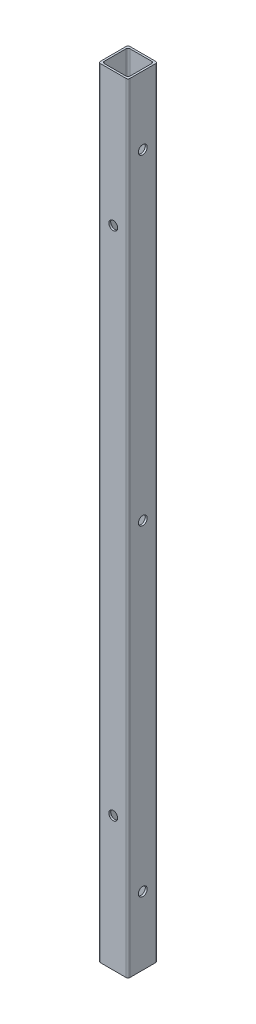
ISO-10303-21;
HEADER;
FILE_DESCRIPTION(('STEP AP214'),'2;1');
FILE_NAME('part.step','',(''),(''),'','','');
FILE_SCHEMA(('AUTOMOTIVE_DESIGN { 1 0 10303 214 1 1 1 1 }'));
ENDSEC;
DATA;
#1=APPLICATION_CONTEXT('core data for automotive mechanical design processes');
#2=APPLICATION_PROTOCOL_DEFINITION('international standard','automotive_design',2000,#1);
#3=PRODUCT_CONTEXT('',#1,'mechanical');
#4=PRODUCT('Part','Part','',(#3));
#5=PRODUCT_RELATED_PRODUCT_CATEGORY('part','',(#4));
#6=PRODUCT_DEFINITION_FORMATION('','',#4);
#7=PRODUCT_DEFINITION_CONTEXT('part definition',#1,'design');
#8=PRODUCT_DEFINITION('design','',#6,#7);
#9=PRODUCT_DEFINITION_SHAPE('','',#8);
#10=(LENGTH_UNIT() NAMED_UNIT(*) SI_UNIT(.MILLI.,.METRE.));
#11=(NAMED_UNIT(*) PLANE_ANGLE_UNIT() SI_UNIT($,.RADIAN.));
#12=(NAMED_UNIT(*) SI_UNIT($,.STERADIAN.) SOLID_ANGLE_UNIT());
#13=UNCERTAINTY_MEASURE_WITH_UNIT(LENGTH_MEASURE(1.E-05),#10,'distance_accuracy_value','');
#14=(GEOMETRIC_REPRESENTATION_CONTEXT(3) GLOBAL_UNCERTAINTY_ASSIGNED_CONTEXT((#13)) GLOBAL_UNIT_ASSIGNED_CONTEXT((#10,
#11,#12)) REPRESENTATION_CONTEXT('',''));
#15=CARTESIAN_POINT('',(0.,0.,0.));
#16=DIRECTION('',(0.,0.,1.));
#17=DIRECTION('',(1.,0.,0.));
#18=AXIS2_PLACEMENT_3D('',#15,#16,#17);
#19=CARTESIAN_POINT('',(0.,508.,0.));
#20=DIRECTION('',(0.,-1.,0.));
#21=DIRECTION('',(0.,0.,-1.));
#22=AXIS2_PLACEMENT_3D('',#19,#20,#21);
#23=PLANE('',#22);
#24=DIRECTION('',(0.,0.,1.));
#25=VECTOR('',#24,1.);
#26=CARTESIAN_POINT('',(-9.652,508.,9.652));
#27=LINE('',#26,#25);
#28=CARTESIAN_POINT('',(-9.652,508.,-8.382));
#29=VERTEX_POINT('',#28);
#30=CARTESIAN_POINT('',(-9.652,508.,8.382));
#31=VERTEX_POINT('',#30);
#32=EDGE_CURVE('E180',#29,#31,#27,.T.);
#33=ORIENTED_EDGE('',*,*,#32,.T.);
#34=CARTESIAN_POINT('',(-8.382,508.,8.382));
#35=DIRECTION('',(0.,-1.,0.));
#36=DIRECTION('',(0.,0.,-1.));
#37=AXIS2_PLACEMENT_3D('',#34,#35,#36);
#38=CIRCLE('',#37,1.27);
#39=CARTESIAN_POINT('',(-8.382,508.,9.652));
#40=VERTEX_POINT('',#39);
#41=EDGE_CURVE('E222',#31,#40,#38,.F.);
#42=ORIENTED_EDGE('',*,*,#41,.T.);
#43=DIRECTION('',(1.,0.,0.));
#44=VECTOR('',#43,1.);
#45=CARTESIAN_POINT('',(-9.652,508.,9.652));
#46=LINE('',#45,#44);
#47=CARTESIAN_POINT('',(8.382,508.,9.652));
#48=VERTEX_POINT('',#47);
#49=EDGE_CURVE('E175',#40,#48,#46,.T.);
#50=ORIENTED_EDGE('',*,*,#49,.T.);
#51=CARTESIAN_POINT('',(8.382,508.,8.382));
#52=DIRECTION('',(0.,-1.,0.));
#53=DIRECTION('',(0.,0.,-1.));
#54=AXIS2_PLACEMENT_3D('',#51,#52,#53);
#55=CIRCLE('',#54,1.27);
#56=CARTESIAN_POINT('',(9.652,508.,8.382));
#57=VERTEX_POINT('',#56);
#58=EDGE_CURVE('E217',#48,#57,#55,.F.);
#59=ORIENTED_EDGE('',*,*,#58,.T.);
#60=DIRECTION('',(0.,0.,-1.));
#61=VECTOR('',#60,1.);
#62=CARTESIAN_POINT('',(9.652,508.,9.652));
#63=LINE('',#62,#61);
#64=CARTESIAN_POINT('',(9.652,508.,-8.382));
#65=VERTEX_POINT('',#64);
#66=EDGE_CURVE('E301',#57,#65,#63,.T.);
#67=ORIENTED_EDGE('',*,*,#66,.T.);
#68=CARTESIAN_POINT('',(8.382,508.,-8.382));
#69=DIRECTION('',(0.,-1.,0.));
#70=DIRECTION('',(0.,0.,-1.));
#71=AXIS2_PLACEMENT_3D('',#68,#69,#70);
#72=CIRCLE('',#71,1.27);
#73=CARTESIAN_POINT('',(8.382,508.,-9.652));
#74=VERTEX_POINT('',#73);
#75=EDGE_CURVE('E58',#65,#74,#72,.F.);
#76=ORIENTED_EDGE('',*,*,#75,.T.);
#77=DIRECTION('',(-1.,0.,0.));
#78=VECTOR('',#77,1.);
#79=CARTESIAN_POINT('',(-9.652,508.,-9.652));
#80=LINE('',#79,#78);
#81=CARTESIAN_POINT('',(-8.382,508.,-9.652));
#82=VERTEX_POINT('',#81);
#83=EDGE_CURVE('E303',#74,#82,#80,.T.);
#84=ORIENTED_EDGE('',*,*,#83,.T.);
#85=CARTESIAN_POINT('',(-8.382,508.,-8.382));
#86=DIRECTION('',(0.,-1.,0.));
#87=DIRECTION('',(0.,0.,-1.));
#88=AXIS2_PLACEMENT_3D('',#85,#86,#87);
#89=CIRCLE('',#88,1.27);
#90=EDGE_CURVE('E220',#82,#29,#89,.F.);
#91=ORIENTED_EDGE('',*,*,#90,.T.);
#92=EDGE_LOOP('',(#33,#42,#50,#59,#67,#76,#84,#91));
#93=FACE_BOUND('',#92,.T.);
#94=DIRECTION('',(1.,0.,0.));
#95=VECTOR('',#94,1.);
#96=CARTESIAN_POINT('',(-8.382,508.,8.382));
#97=LINE('',#96,#95);
#98=CARTESIAN_POINT('',(-7.112,508.,8.382));
#99=VERTEX_POINT('',#98);
#100=CARTESIAN_POINT('',(7.112,508.,8.382));
#101=VERTEX_POINT('',#100);
#102=EDGE_CURVE('E284',#99,#101,#97,.T.);
#103=ORIENTED_EDGE('',*,*,#102,.F.);
#104=CARTESIAN_POINT('',(-7.112,508.,7.112));
#105=DIRECTION('',(0.,-1.,0.));
#106=DIRECTION('',(0.,0.,-1.));
#107=AXIS2_PLACEMENT_3D('',#104,#105,#106);
#108=CIRCLE('',#107,1.27);
#109=CARTESIAN_POINT('',(-8.382,508.,7.112));
#110=VERTEX_POINT('',#109);
#111=EDGE_CURVE('E11',#99,#110,#108,.T.);
#112=ORIENTED_EDGE('',*,*,#111,.T.);
#113=DIRECTION('',(0.,0.,1.));
#114=VECTOR('',#113,1.);
#115=CARTESIAN_POINT('',(-8.382,508.,8.382));
#116=LINE('',#115,#114);
#117=CARTESIAN_POINT('',(-8.382,508.,-7.11199999999999));
#118=VERTEX_POINT('',#117);
#119=EDGE_CURVE('E292',#118,#110,#116,.T.);
#120=ORIENTED_EDGE('',*,*,#119,.F.);
#121=CARTESIAN_POINT('',(-7.112,508.,-7.112));
#122=DIRECTION('',(0.,-1.,0.));
#123=DIRECTION('',(0.,0.,-1.));
#124=AXIS2_PLACEMENT_3D('',#121,#122,#123);
#125=CIRCLE('',#124,1.27);
#126=CARTESIAN_POINT('',(-7.112,508.,-8.382));
#127=VERTEX_POINT('',#126);
#128=EDGE_CURVE('E235',#118,#127,#125,.T.);
#129=ORIENTED_EDGE('',*,*,#128,.T.);
#130=DIRECTION('',(-1.,0.,0.));
#131=VECTOR('',#130,1.);
#132=CARTESIAN_POINT('',(-8.382,508.,-8.382));
#133=LINE('',#132,#131);
#134=CARTESIAN_POINT('',(7.112,508.,-8.382));
#135=VERTEX_POINT('',#134);
#136=EDGE_CURVE('E290',#135,#127,#133,.T.);
#137=ORIENTED_EDGE('',*,*,#136,.F.);
#138=CARTESIAN_POINT('',(7.112,508.,-7.112));
#139=DIRECTION('',(0.,-1.,0.));
#140=DIRECTION('',(0.,0.,-1.));
#141=AXIS2_PLACEMENT_3D('',#138,#139,#140);
#142=CIRCLE('',#141,1.27);
#143=CARTESIAN_POINT('',(8.382,508.,-7.11199999999999));
#144=VERTEX_POINT('',#143);
#145=EDGE_CURVE('E160',#135,#144,#142,.T.);
#146=ORIENTED_EDGE('',*,*,#145,.T.);
#147=DIRECTION('',(0.,0.,-1.));
#148=VECTOR('',#147,1.);
#149=CARTESIAN_POINT('',(8.382,508.,8.382));
#150=LINE('',#149,#148);
#151=CARTESIAN_POINT('',(8.382,508.,7.112));
#152=VERTEX_POINT('',#151);
#153=EDGE_CURVE('E287',#152,#144,#150,.T.);
#154=ORIENTED_EDGE('',*,*,#153,.F.);
#155=CARTESIAN_POINT('',(7.112,508.,7.112));
#156=DIRECTION('',(0.,-1.,0.));
#157=DIRECTION('',(0.,0.,-1.));
#158=AXIS2_PLACEMENT_3D('',#155,#156,#157);
#159=CIRCLE('',#158,1.27);
#160=EDGE_CURVE('E161',#152,#101,#159,.T.);
#161=ORIENTED_EDGE('',*,*,#160,.T.);
#162=EDGE_LOOP('',(#103,#112,#120,#129,#137,#146,#154,#161));
#163=FACE_BOUND('',#162,.T.);
#164=ADVANCED_FACE('F34',(#93,#163),#23,.F.);
#165=CARTESIAN_POINT('',(0.,0.,0.));
#166=DIRECTION('',(0.,-1.,0.));
#167=DIRECTION('',(0.,0.,-1.));
#168=AXIS2_PLACEMENT_3D('',#165,#166,#167);
#169=PLANE('',#168);
#170=DIRECTION('',(1.,0.,0.));
#171=VECTOR('',#170,1.);
#172=CARTESIAN_POINT('',(-9.652,0.,9.652));
#173=LINE('',#172,#171);
#174=CARTESIAN_POINT('',(-8.382,0.,9.652));
#175=VERTEX_POINT('',#174);
#176=CARTESIAN_POINT('',(8.382,0.,9.652));
#177=VERTEX_POINT('',#176);
#178=EDGE_CURVE('E183',#175,#177,#173,.T.);
#179=ORIENTED_EDGE('',*,*,#178,.F.);
#180=CARTESIAN_POINT('',(-8.382,0.,8.382));
#181=DIRECTION('',(0.,-1.,0.));
#182=DIRECTION('',(0.,0.,-1.));
#183=AXIS2_PLACEMENT_3D('',#180,#181,#182);
#184=CIRCLE('',#183,1.27);
#185=CARTESIAN_POINT('',(-9.652,0.,8.382));
#186=VERTEX_POINT('',#185);
#187=EDGE_CURVE('E210',#175,#186,#184,.T.);
#188=ORIENTED_EDGE('',*,*,#187,.T.);
#189=DIRECTION('',(0.,0.,1.));
#190=VECTOR('',#189,1.);
#191=CARTESIAN_POINT('',(-9.652,0.,9.652));
#192=LINE('',#191,#190);
#193=CARTESIAN_POINT('',(-9.652,0.,-8.382));
#194=VERTEX_POINT('',#193);
#195=EDGE_CURVE('E310',#194,#186,#192,.T.);
#196=ORIENTED_EDGE('',*,*,#195,.F.);
#197=CARTESIAN_POINT('',(-8.382,0.,-8.382));
#198=DIRECTION('',(0.,-1.,0.));
#199=DIRECTION('',(0.,0.,-1.));
#200=AXIS2_PLACEMENT_3D('',#197,#198,#199);
#201=CIRCLE('',#200,1.27);
#202=CARTESIAN_POINT('',(-8.382,0.,-9.652));
#203=VERTEX_POINT('',#202);
#204=EDGE_CURVE('E208',#194,#203,#201,.T.);
#205=ORIENTED_EDGE('',*,*,#204,.T.);
#206=DIRECTION('',(-1.,0.,0.));
#207=VECTOR('',#206,1.);
#208=CARTESIAN_POINT('',(-9.652,0.,-9.652));
#209=LINE('',#208,#207);
#210=CARTESIAN_POINT('',(8.382,0.,-9.652));
#211=VERTEX_POINT('',#210);
#212=EDGE_CURVE('E309',#211,#203,#209,.T.);
#213=ORIENTED_EDGE('',*,*,#212,.F.);
#214=CARTESIAN_POINT('',(8.382,0.,-8.382));
#215=DIRECTION('',(0.,-1.,0.));
#216=DIRECTION('',(0.,0.,-1.));
#217=AXIS2_PLACEMENT_3D('',#214,#215,#216);
#218=CIRCLE('',#217,1.27);
#219=CARTESIAN_POINT('',(9.652,0.,-8.382));
#220=VERTEX_POINT('',#219);
#221=EDGE_CURVE('E206',#211,#220,#218,.T.);
#222=ORIENTED_EDGE('',*,*,#221,.T.);
#223=DIRECTION('',(0.,0.,-1.));
#224=VECTOR('',#223,1.);
#225=CARTESIAN_POINT('',(9.652,0.,9.652));
#226=LINE('',#225,#224);
#227=CARTESIAN_POINT('',(9.652,0.,8.382));
#228=VERTEX_POINT('',#227);
#229=EDGE_CURVE('E295',#228,#220,#226,.T.);
#230=ORIENTED_EDGE('',*,*,#229,.F.);
#231=CARTESIAN_POINT('',(8.382,0.,8.382));
#232=DIRECTION('',(0.,-1.,0.));
#233=DIRECTION('',(0.,0.,-1.));
#234=AXIS2_PLACEMENT_3D('',#231,#232,#233);
#235=CIRCLE('',#234,1.27);
#236=EDGE_CURVE('E204',#228,#177,#235,.T.);
#237=ORIENTED_EDGE('',*,*,#236,.T.);
#238=EDGE_LOOP('',(#179,#188,#196,#205,#213,#222,#230,#237));
#239=FACE_BOUND('',#238,.T.);
#240=DIRECTION('',(-1.,0.,0.));
#241=VECTOR('',#240,1.);
#242=CARTESIAN_POINT('',(-8.382,0.,-8.382));
#243=LINE('',#242,#241);
#244=CARTESIAN_POINT('',(7.112,0.,-8.382));
#245=VERTEX_POINT('',#244);
#246=CARTESIAN_POINT('',(-7.112,0.,-8.382));
#247=VERTEX_POINT('',#246);
#248=EDGE_CURVE('E153',#245,#247,#243,.T.);
#249=ORIENTED_EDGE('',*,*,#248,.T.);
#250=CARTESIAN_POINT('',(-7.112,0.,-7.112));
#251=DIRECTION('',(0.,-1.,0.));
#252=DIRECTION('',(0.,0.,-1.));
#253=AXIS2_PLACEMENT_3D('',#250,#251,#252);
#254=CIRCLE('',#253,1.27);
#255=CARTESIAN_POINT('',(-8.382,0.,-7.11199999999999));
#256=VERTEX_POINT('',#255);
#257=EDGE_CURVE('E233',#247,#256,#254,.F.);
#258=ORIENTED_EDGE('',*,*,#257,.T.);
#259=DIRECTION('',(0.,0.,1.));
#260=VECTOR('',#259,1.);
#261=CARTESIAN_POINT('',(-8.382,0.,8.382));
#262=LINE('',#261,#260);
#263=CARTESIAN_POINT('',(-8.382,0.,7.112));
#264=VERTEX_POINT('',#263);
#265=EDGE_CURVE('E171',#256,#264,#262,.T.);
#266=ORIENTED_EDGE('',*,*,#265,.T.);
#267=CARTESIAN_POINT('',(-7.112,0.,7.112));
#268=DIRECTION('',(0.,-1.,0.));
#269=DIRECTION('',(0.,0.,-1.));
#270=AXIS2_PLACEMENT_3D('',#267,#268,#269);
#271=CIRCLE('',#270,1.27);
#272=CARTESIAN_POINT('',(-7.112,0.,8.382));
#273=VERTEX_POINT('',#272);
#274=EDGE_CURVE('E43',#264,#273,#271,.F.);
#275=ORIENTED_EDGE('',*,*,#274,.T.);
#276=DIRECTION('',(1.,0.,0.));
#277=VECTOR('',#276,1.);
#278=CARTESIAN_POINT('',(-8.382,0.,8.382));
#279=LINE('',#278,#277);
#280=CARTESIAN_POINT('',(7.112,0.,8.382));
#281=VERTEX_POINT('',#280);
#282=EDGE_CURVE('E283',#273,#281,#279,.T.);
#283=ORIENTED_EDGE('',*,*,#282,.T.);
#284=CARTESIAN_POINT('',(7.112,0.,7.112));
#285=DIRECTION('',(0.,-1.,0.));
#286=DIRECTION('',(0.,0.,-1.));
#287=AXIS2_PLACEMENT_3D('',#284,#285,#286);
#288=CIRCLE('',#287,1.27);
#289=CARTESIAN_POINT('',(8.382,0.,7.112));
#290=VERTEX_POINT('',#289);
#291=EDGE_CURVE('E237',#281,#290,#288,.F.);
#292=ORIENTED_EDGE('',*,*,#291,.T.);
#293=DIRECTION('',(0.,0.,-1.));
#294=VECTOR('',#293,1.);
#295=CARTESIAN_POINT('',(8.382,0.,8.382));
#296=LINE('',#295,#294);
#297=CARTESIAN_POINT('',(8.382,0.,-7.11199999999999));
#298=VERTEX_POINT('',#297);
#299=EDGE_CURVE('E155',#290,#298,#296,.T.);
#300=ORIENTED_EDGE('',*,*,#299,.T.);
#301=CARTESIAN_POINT('',(7.112,0.,-7.112));
#302=DIRECTION('',(0.,-1.,0.));
#303=DIRECTION('',(0.,0.,-1.));
#304=AXIS2_PLACEMENT_3D('',#301,#302,#303);
#305=CIRCLE('',#304,1.27);
#306=EDGE_CURVE('E150',#298,#245,#305,.F.);
#307=ORIENTED_EDGE('',*,*,#306,.T.);
#308=EDGE_LOOP('',(#249,#258,#266,#275,#283,#292,#300,#307));
#309=FACE_BOUND('',#308,.T.);
#310=ADVANCED_FACE('F152',(#239,#309),#169,.T.);
#311=CARTESIAN_POINT('',(9.652,508.,9.652));
#312=DIRECTION('',(-1.,0.,0.));
#313=DIRECTION('',(0.,0.,1.));
#314=AXIS2_PLACEMENT_3D('',#311,#312,#313);
#315=PLANE('',#314);
#316=CARTESIAN_POINT('',(9.652,44.45,0.));
#317=DIRECTION('',(-1.,0.,0.));
#318=DIRECTION('',(0.,0.,1.));
#319=AXIS2_PLACEMENT_3D('',#316,#317,#318);
#320=CIRCLE('',#319,2.8956);
#321=CARTESIAN_POINT('',(9.652,44.45,2.8956));
#322=VERTEX_POINT('',#321);
#323=EDGE_CURVE('E254',#322,#322,#320,.T.);
#324=ORIENTED_EDGE('',*,*,#323,.T.);
#325=EDGE_LOOP('',(#324));
#326=FACE_BOUND('',#325,.T.);
#327=CARTESIAN_POINT('',(9.652,254.,0.));
#328=DIRECTION('',(-1.,0.,0.));
#329=DIRECTION('',(0.,0.,1.));
#330=AXIS2_PLACEMENT_3D('',#327,#328,#329);
#331=CIRCLE('',#330,2.8956);
#332=CARTESIAN_POINT('',(9.652,254.,2.8956));
#333=VERTEX_POINT('',#332);
#334=EDGE_CURVE('E250',#333,#333,#331,.T.);
#335=ORIENTED_EDGE('',*,*,#334,.T.);
#336=EDGE_LOOP('',(#335));
#337=FACE_BOUND('',#336,.T.);
#338=CARTESIAN_POINT('',(9.652,463.55,0.));
#339=DIRECTION('',(-1.,0.,0.));
#340=DIRECTION('',(0.,0.,1.));
#341=AXIS2_PLACEMENT_3D('',#338,#339,#340);
#342=CIRCLE('',#341,2.8956);
#343=CARTESIAN_POINT('',(9.652,463.55,2.8956));
#344=VERTEX_POINT('',#343);
#345=EDGE_CURVE('E246',#344,#344,#342,.T.);
#346=ORIENTED_EDGE('',*,*,#345,.T.);
#347=EDGE_LOOP('',(#346));
#348=FACE_BOUND('',#347,.T.);
#349=ORIENTED_EDGE('',*,*,#229,.T.);
#350=DIRECTION('',(0.,-1.,0.));
#351=VECTOR('',#350,1.);
#352=CARTESIAN_POINT('',(9.652,508.,-8.382));
#353=LINE('',#352,#351);
#354=EDGE_CURVE('E231',#220,#65,#353,.F.);
#355=ORIENTED_EDGE('',*,*,#354,.T.);
#356=ORIENTED_EDGE('',*,*,#66,.F.);
#357=DIRECTION('',(0.,-1.,0.));
#358=VECTOR('',#357,1.);
#359=CARTESIAN_POINT('',(9.652,508.,8.382));
#360=LINE('',#359,#358);
#361=EDGE_CURVE('E228',#57,#228,#360,.T.);
#362=ORIENTED_EDGE('',*,*,#361,.T.);
#363=EDGE_LOOP('',(#349,#355,#356,#362));
#364=FACE_BOUND('',#363,.T.);
#365=ADVANCED_FACE('F329',(#326,#337,#348,#364),#315,.F.);
#366=CARTESIAN_POINT('',(-9.652,508.,-9.652));
#367=DIRECTION('',(0.,0.,1.));
#368=DIRECTION('',(1.,0.,0.));
#369=AXIS2_PLACEMENT_3D('',#366,#367,#368);
#370=PLANE('',#369);
#371=CARTESIAN_POINT('',(0.,87.3125,-9.652));
#372=DIRECTION('',(0.,0.,-1.));
#373=DIRECTION('',(-1.,0.,0.));
#374=AXIS2_PLACEMENT_3D('',#371,#372,#373);
#375=CIRCLE('',#374,2.89559999999999);
#376=CARTESIAN_POINT('',(-2.89560000000004,87.3125,-9.652));
#377=VERTEX_POINT('',#376);
#378=EDGE_CURVE('E715',#377,#377,#375,.T.);
#379=ORIENTED_EDGE('',*,*,#378,.F.);
#380=EDGE_LOOP('',(#379));
#381=FACE_BOUND('',#380,.T.);
#382=CARTESIAN_POINT('',(0.,420.6875,-9.652));
#383=DIRECTION('',(0.,0.,-1.));
#384=DIRECTION('',(-1.,0.,0.));
#385=AXIS2_PLACEMENT_3D('',#382,#383,#384);
#386=CIRCLE('',#385,2.89559999999999);
#387=CARTESIAN_POINT('',(-2.8956,420.6875,-9.652));
#388=VERTEX_POINT('',#387);
#389=EDGE_CURVE('E702',#388,#388,#386,.T.);
#390=ORIENTED_EDGE('',*,*,#389,.F.);
#391=EDGE_LOOP('',(#390));
#392=FACE_BOUND('',#391,.T.);
#393=ORIENTED_EDGE('',*,*,#212,.T.);
#394=DIRECTION('',(0.,-1.,0.));
#395=VECTOR('',#394,1.);
#396=CARTESIAN_POINT('',(-8.382,508.,-9.652));
#397=LINE('',#396,#395);
#398=EDGE_CURVE('E51',#203,#82,#397,.F.);
#399=ORIENTED_EDGE('',*,*,#398,.T.);
#400=ORIENTED_EDGE('',*,*,#83,.F.);
#401=DIRECTION('',(0.,-1.,0.));
#402=VECTOR('',#401,1.);
#403=CARTESIAN_POINT('',(8.382,508.,-9.652));
#404=LINE('',#403,#402);
#405=EDGE_CURVE('E224',#74,#211,#404,.T.);
#406=ORIENTED_EDGE('',*,*,#405,.T.);
#407=EDGE_LOOP('',(#393,#399,#400,#406));
#408=FACE_BOUND('',#407,.T.);
#409=ADVANCED_FACE('F336',(#381,#392,#408),#370,.F.);
#410=CARTESIAN_POINT('',(-9.652,508.,9.652));
#411=DIRECTION('',(1.,0.,0.));
#412=DIRECTION('',(0.,0.,-1.));
#413=AXIS2_PLACEMENT_3D('',#410,#411,#412);
#414=PLANE('',#413);
#415=CARTESIAN_POINT('',(-9.652,44.45,0.));
#416=DIRECTION('',(-1.,0.,0.));
#417=DIRECTION('',(0.,0.,1.));
#418=AXIS2_PLACEMENT_3D('',#415,#416,#417);
#419=CIRCLE('',#418,2.89559999999998);
#420=CARTESIAN_POINT('',(-9.652,44.45,2.89559999999998));
#421=VERTEX_POINT('',#420);
#422=EDGE_CURVE('E261',#421,#421,#419,.T.);
#423=ORIENTED_EDGE('',*,*,#422,.F.);
#424=EDGE_LOOP('',(#423));
#425=FACE_BOUND('',#424,.T.);
#426=CARTESIAN_POINT('',(-9.652,254.,0.));
#427=DIRECTION('',(-1.,0.,0.));
#428=DIRECTION('',(0.,0.,1.));
#429=AXIS2_PLACEMENT_3D('',#426,#427,#428);
#430=CIRCLE('',#429,2.8956);
#431=CARTESIAN_POINT('',(-9.652,254.,2.8956));
#432=VERTEX_POINT('',#431);
#433=EDGE_CURVE('E258',#432,#432,#430,.T.);
#434=ORIENTED_EDGE('',*,*,#433,.F.);
#435=EDGE_LOOP('',(#434));
#436=FACE_BOUND('',#435,.T.);
#437=CARTESIAN_POINT('',(-9.652,463.55,0.));
#438=DIRECTION('',(-1.,0.,0.));
#439=DIRECTION('',(0.,0.,1.));
#440=AXIS2_PLACEMENT_3D('',#437,#438,#439);
#441=CIRCLE('',#440,2.8956);
#442=CARTESIAN_POINT('',(-9.652,463.55,2.8956));
#443=VERTEX_POINT('',#442);
#444=EDGE_CURVE('E276',#443,#443,#441,.T.);
#445=ORIENTED_EDGE('',*,*,#444,.F.);
#446=EDGE_LOOP('',(#445));
#447=FACE_BOUND('',#446,.T.);
#448=ORIENTED_EDGE('',*,*,#195,.T.);
#449=DIRECTION('',(0.,-1.,0.));
#450=VECTOR('',#449,1.);
#451=CARTESIAN_POINT('',(-9.652,508.,8.382));
#452=LINE('',#451,#450);
#453=EDGE_CURVE('E215',#186,#31,#452,.F.);
#454=ORIENTED_EDGE('',*,*,#453,.T.);
#455=ORIENTED_EDGE('',*,*,#32,.F.);
#456=DIRECTION('',(0.,-1.,0.));
#457=VECTOR('',#456,1.);
#458=CARTESIAN_POINT('',(-9.652,508.,-8.382));
#459=LINE('',#458,#457);
#460=EDGE_CURVE('E212',#29,#194,#459,.T.);
#461=ORIENTED_EDGE('',*,*,#460,.T.);
#462=EDGE_LOOP('',(#448,#454,#455,#461));
#463=FACE_BOUND('',#462,.T.);
#464=ADVANCED_FACE('F342',(#425,#436,#447,#463),#414,.F.);
#465=CARTESIAN_POINT('',(-9.652,508.,9.652));
#466=DIRECTION('',(0.,0.,-1.));
#467=DIRECTION('',(-1.,0.,0.));
#468=AXIS2_PLACEMENT_3D('',#465,#466,#467);
#469=PLANE('',#468);
#470=CARTESIAN_POINT('',(0.,87.3125,9.652));
#471=DIRECTION('',(0.,0.,-1.));
#472=DIRECTION('',(-1.,0.,0.));
#473=AXIS2_PLACEMENT_3D('',#470,#471,#472);
#474=CIRCLE('',#473,2.8956);
#475=CARTESIAN_POINT('',(-2.89560000000005,87.3125,9.652));
#476=VERTEX_POINT('',#475);
#477=EDGE_CURVE('E712',#476,#476,#474,.T.);
#478=ORIENTED_EDGE('',*,*,#477,.T.);
#479=EDGE_LOOP('',(#478));
#480=FACE_BOUND('',#479,.T.);
#481=CARTESIAN_POINT('',(0.,420.6875,9.652));
#482=DIRECTION('',(0.,0.,-1.));
#483=DIRECTION('',(-1.,0.,0.));
#484=AXIS2_PLACEMENT_3D('',#481,#482,#483);
#485=CIRCLE('',#484,2.8956);
#486=CARTESIAN_POINT('',(-2.89560000000001,420.6875,9.652));
#487=VERTEX_POINT('',#486);
#488=EDGE_CURVE('E699',#487,#487,#485,.T.);
#489=ORIENTED_EDGE('',*,*,#488,.T.);
#490=EDGE_LOOP('',(#489));
#491=FACE_BOUND('',#490,.T.);
#492=ORIENTED_EDGE('',*,*,#49,.F.);
#493=DIRECTION('',(0.,-1.,0.));
#494=VECTOR('',#493,1.);
#495=CARTESIAN_POINT('',(-8.382,508.,9.652));
#496=LINE('',#495,#494);
#497=EDGE_CURVE('E201',#40,#175,#496,.T.);
#498=ORIENTED_EDGE('',*,*,#497,.T.);
#499=ORIENTED_EDGE('',*,*,#178,.T.);
#500=DIRECTION('',(0.,-1.,0.));
#501=VECTOR('',#500,1.);
#502=CARTESIAN_POINT('',(8.382,508.,9.652));
#503=LINE('',#502,#501);
#504=EDGE_CURVE('E199',#177,#48,#503,.F.);
#505=ORIENTED_EDGE('',*,*,#504,.T.);
#506=EDGE_LOOP('',(#492,#498,#499,#505));
#507=FACE_BOUND('',#506,.T.);
#508=ADVANCED_FACE('F320',(#480,#491,#507),#469,.F.);
#509=CARTESIAN_POINT('',(-8.382,508.,8.382));
#510=DIRECTION('',(0.,0.,-1.));
#511=DIRECTION('',(-1.,0.,0.));
#512=AXIS2_PLACEMENT_3D('',#509,#510,#511);
#513=PLANE('',#512);
#514=CARTESIAN_POINT('',(0.,87.3125,8.382));
#515=DIRECTION('',(0.,0.,-1.));
#516=DIRECTION('',(-1.,0.,0.));
#517=AXIS2_PLACEMENT_3D('',#514,#515,#516);
#518=CIRCLE('',#517,2.89559999999999);
#519=CARTESIAN_POINT('',(-2.89560000000004,87.3125,8.382));
#520=VERTEX_POINT('',#519);
#521=EDGE_CURVE('E707',#520,#520,#518,.T.);
#522=ORIENTED_EDGE('',*,*,#521,.F.);
#523=EDGE_LOOP('',(#522));
#524=FACE_BOUND('',#523,.T.);
#525=CARTESIAN_POINT('',(0.,420.6875,8.382));
#526=DIRECTION('',(0.,0.,-1.));
#527=DIRECTION('',(-1.,0.,0.));
#528=AXIS2_PLACEMENT_3D('',#525,#526,#527);
#529=CIRCLE('',#528,2.89559999999999);
#530=CARTESIAN_POINT('',(-2.8956,420.6875,8.382));
#531=VERTEX_POINT('',#530);
#532=EDGE_CURVE('E266',#531,#531,#529,.T.);
#533=ORIENTED_EDGE('',*,*,#532,.F.);
#534=EDGE_LOOP('',(#533));
#535=FACE_BOUND('',#534,.T.);
#536=ORIENTED_EDGE('',*,*,#102,.T.);
#537=DIRECTION('',(0.,-1.,0.));
#538=VECTOR('',#537,1.);
#539=CARTESIAN_POINT('',(7.112,0.,8.382));
#540=LINE('',#539,#538);
#541=EDGE_CURVE('E192',#101,#281,#540,.T.);
#542=ORIENTED_EDGE('',*,*,#541,.T.);
#543=ORIENTED_EDGE('',*,*,#282,.F.);
#544=DIRECTION('',(0.,-1.,0.));
#545=VECTOR('',#544,1.);
#546=CARTESIAN_POINT('',(-7.112,508.,8.382));
#547=LINE('',#546,#545);
#548=EDGE_CURVE('E190',#273,#99,#547,.F.);
#549=ORIENTED_EDGE('',*,*,#548,.T.);
#550=EDGE_LOOP('',(#536,#542,#543,#549));
#551=FACE_BOUND('',#550,.T.);
#552=ADVANCED_FACE('F363',(#524,#535,#551),#513,.T.);
#553=CARTESIAN_POINT('',(8.382,508.,8.382));
#554=DIRECTION('',(-1.,0.,0.));
#555=DIRECTION('',(0.,0.,1.));
#556=AXIS2_PLACEMENT_3D('',#553,#554,#555);
#557=PLANE('',#556);
#558=CARTESIAN_POINT('',(8.382,44.45,0.));
#559=DIRECTION('',(-1.,0.,0.));
#560=DIRECTION('',(0.,0.,1.));
#561=AXIS2_PLACEMENT_3D('',#558,#559,#560);
#562=CIRCLE('',#561,2.89559999999999);
#563=CARTESIAN_POINT('',(8.382,44.45,2.89559999999999));
#564=VERTEX_POINT('',#563);
#565=EDGE_CURVE('E253',#564,#564,#562,.T.);
#566=ORIENTED_EDGE('',*,*,#565,.F.);
#567=EDGE_LOOP('',(#566));
#568=FACE_BOUND('',#567,.T.);
#569=CARTESIAN_POINT('',(8.382,254.,0.));
#570=DIRECTION('',(-1.,0.,0.));
#571=DIRECTION('',(0.,0.,1.));
#572=AXIS2_PLACEMENT_3D('',#569,#570,#571);
#573=CIRCLE('',#572,2.8956);
#574=CARTESIAN_POINT('',(8.382,254.,2.8956));
#575=VERTEX_POINT('',#574);
#576=EDGE_CURVE('E249',#575,#575,#573,.T.);
#577=ORIENTED_EDGE('',*,*,#576,.F.);
#578=EDGE_LOOP('',(#577));
#579=FACE_BOUND('',#578,.T.);
#580=CARTESIAN_POINT('',(8.382,463.55,0.));
#581=DIRECTION('',(-1.,0.,0.));
#582=DIRECTION('',(0.,0.,1.));
#583=AXIS2_PLACEMENT_3D('',#580,#581,#582);
#584=CIRCLE('',#583,2.8956);
#585=CARTESIAN_POINT('',(8.382,463.55,2.8956));
#586=VERTEX_POINT('',#585);
#587=EDGE_CURVE('E242',#586,#586,#584,.T.);
#588=ORIENTED_EDGE('',*,*,#587,.F.);
#589=EDGE_LOOP('',(#588));
#590=FACE_BOUND('',#589,.T.);
#591=ORIENTED_EDGE('',*,*,#299,.F.);
#592=DIRECTION('',(0.,-1.,0.));
#593=VECTOR('',#592,1.);
#594=CARTESIAN_POINT('',(8.382,508.,7.112));
#595=LINE('',#594,#593);
#596=EDGE_CURVE('E197',#290,#152,#595,.F.);
#597=ORIENTED_EDGE('',*,*,#596,.T.);
#598=ORIENTED_EDGE('',*,*,#153,.T.);
#599=DIRECTION('',(0.,-1.,0.));
#600=VECTOR('',#599,1.);
#601=CARTESIAN_POINT('',(8.382,0.,-7.112));
#602=LINE('',#601,#600);
#603=EDGE_CURVE('E195',#144,#298,#602,.T.);
#604=ORIENTED_EDGE('',*,*,#603,.T.);
#605=EDGE_LOOP('',(#591,#597,#598,#604));
#606=FACE_BOUND('',#605,.T.);
#607=ADVANCED_FACE('F446',(#568,#579,#590,#606),#557,.T.);
#608=CARTESIAN_POINT('',(-8.382,508.,-8.382));
#609=DIRECTION('',(0.,0.,1.));
#610=DIRECTION('',(1.,0.,0.));
#611=AXIS2_PLACEMENT_3D('',#608,#609,#610);
#612=PLANE('',#611);
#613=CARTESIAN_POINT('',(0.,87.3125,-8.382));
#614=DIRECTION('',(0.,0.,1.));
#615=DIRECTION('',(1.,0.,0.));
#616=AXIS2_PLACEMENT_3D('',#613,#614,#615);
#617=CIRCLE('',#616,2.89559999999999);
#618=CARTESIAN_POINT('',(2.89559999999994,87.3125,-8.382));
#619=VERTEX_POINT('',#618);
#620=EDGE_CURVE('E38',#619,#619,#617,.T.);
#621=ORIENTED_EDGE('',*,*,#620,.F.);
#622=EDGE_LOOP('',(#621));
#623=FACE_BOUND('',#622,.T.);
#624=CARTESIAN_POINT('',(0.,420.6875,-8.382));
#625=DIRECTION('',(0.,0.,1.));
#626=DIRECTION('',(1.,0.,0.));
#627=AXIS2_PLACEMENT_3D('',#624,#625,#626);
#628=CIRCLE('',#627,2.89559999999999);
#629=CARTESIAN_POINT('',(2.89559999999998,420.6875,-8.382));
#630=VERTEX_POINT('',#629);
#631=EDGE_CURVE('E701',#630,#630,#628,.T.);
#632=ORIENTED_EDGE('',*,*,#631,.F.);
#633=EDGE_LOOP('',(#632));
#634=FACE_BOUND('',#633,.T.);
#635=ORIENTED_EDGE('',*,*,#136,.T.);
#636=DIRECTION('',(0.,-1.,0.));
#637=VECTOR('',#636,1.);
#638=CARTESIAN_POINT('',(-7.112,0.,-8.382));
#639=LINE('',#638,#637);
#640=EDGE_CURVE('E170',#127,#247,#639,.T.);
#641=ORIENTED_EDGE('',*,*,#640,.T.);
#642=ORIENTED_EDGE('',*,*,#248,.F.);
#643=DIRECTION('',(0.,-1.,0.));
#644=VECTOR('',#643,1.);
#645=CARTESIAN_POINT('',(7.112,508.,-8.382));
#646=LINE('',#645,#644);
#647=EDGE_CURVE('E167',#245,#135,#646,.F.);
#648=ORIENTED_EDGE('',*,*,#647,.T.);
#649=EDGE_LOOP('',(#635,#641,#642,#648));
#650=FACE_BOUND('',#649,.T.);
#651=ADVANCED_FACE('F166',(#623,#634,#650),#612,.T.);
#652=CARTESIAN_POINT('',(-8.382,508.,8.382));
#653=DIRECTION('',(1.,0.,0.));
#654=DIRECTION('',(0.,0.,-1.));
#655=AXIS2_PLACEMENT_3D('',#652,#653,#654);
#656=PLANE('',#655);
#657=CARTESIAN_POINT('',(-8.382,44.45,0.));
#658=DIRECTION('',(1.,0.,0.));
#659=DIRECTION('',(0.,0.,-1.));
#660=AXIS2_PLACEMENT_3D('',#657,#658,#659);
#661=CIRCLE('',#660,2.89559999999999);
#662=CARTESIAN_POINT('',(-8.382,44.45,-2.89559999999999));
#663=VERTEX_POINT('',#662);
#664=EDGE_CURVE('E251',#663,#663,#661,.T.);
#665=ORIENTED_EDGE('',*,*,#664,.F.);
#666=EDGE_LOOP('',(#665));
#667=FACE_BOUND('',#666,.T.);
#668=CARTESIAN_POINT('',(-8.382,254.,0.));
#669=DIRECTION('',(1.,0.,0.));
#670=DIRECTION('',(0.,0.,-1.));
#671=AXIS2_PLACEMENT_3D('',#668,#669,#670);
#672=CIRCLE('',#671,2.8956);
#673=CARTESIAN_POINT('',(-8.382,254.,-2.8956));
#674=VERTEX_POINT('',#673);
#675=EDGE_CURVE('E247',#674,#674,#672,.T.);
#676=ORIENTED_EDGE('',*,*,#675,.F.);
#677=EDGE_LOOP('',(#676));
#678=FACE_BOUND('',#677,.T.);
#679=CARTESIAN_POINT('',(-8.382,463.55,0.));
#680=DIRECTION('',(1.,0.,0.));
#681=DIRECTION('',(0.,0.,-1.));
#682=AXIS2_PLACEMENT_3D('',#679,#680,#681);
#683=CIRCLE('',#682,2.8956);
#684=CARTESIAN_POINT('',(-8.382,463.55,-2.8956));
#685=VERTEX_POINT('',#684);
#686=EDGE_CURVE('E245',#685,#685,#683,.T.);
#687=ORIENTED_EDGE('',*,*,#686,.F.);
#688=EDGE_LOOP('',(#687));
#689=FACE_BOUND('',#688,.T.);
#690=ORIENTED_EDGE('',*,*,#265,.F.);
#691=DIRECTION('',(0.,-1.,0.));
#692=VECTOR('',#691,1.);
#693=CARTESIAN_POINT('',(-8.382,508.,-7.112));
#694=LINE('',#693,#692);
#695=EDGE_CURVE('E188',#256,#118,#694,.F.);
#696=ORIENTED_EDGE('',*,*,#695,.T.);
#697=ORIENTED_EDGE('',*,*,#119,.T.);
#698=DIRECTION('',(0.,-1.,0.));
#699=VECTOR('',#698,1.);
#700=CARTESIAN_POINT('',(-8.382,0.,7.112));
#701=LINE('',#700,#699);
#702=EDGE_CURVE('E177',#110,#264,#701,.T.);
#703=ORIENTED_EDGE('',*,*,#702,.T.);
#704=EDGE_LOOP('',(#690,#696,#697,#703));
#705=FACE_BOUND('',#704,.T.);
#706=ADVANCED_FACE('F381',(#667,#678,#689,#705),#656,.T.);
#707=CARTESIAN_POINT('',(-7.112,508.,-7.112));
#708=DIRECTION('',(0.,1.,0.));
#709=DIRECTION('',(0.,0.,1.));
#710=AXIS2_PLACEMENT_3D('',#707,#708,#709);
#711=CYLINDRICAL_SURFACE('',#710,1.27);
#712=ORIENTED_EDGE('',*,*,#128,.F.);
#713=ORIENTED_EDGE('',*,*,#695,.F.);
#714=ORIENTED_EDGE('',*,*,#257,.F.);
#715=ORIENTED_EDGE('',*,*,#640,.F.);
#716=EDGE_LOOP('',(#712,#713,#714,#715));
#717=FACE_BOUND('',#716,.T.);
#718=ADVANCED_FACE('F377',(#717),#711,.F.);
#719=CARTESIAN_POINT('',(7.112,508.,7.112));
#720=DIRECTION('',(0.,1.,0.));
#721=DIRECTION('',(0.,0.,1.));
#722=AXIS2_PLACEMENT_3D('',#719,#720,#721);
#723=CYLINDRICAL_SURFACE('',#722,1.27);
#724=ORIENTED_EDGE('',*,*,#160,.F.);
#725=ORIENTED_EDGE('',*,*,#596,.F.);
#726=ORIENTED_EDGE('',*,*,#291,.F.);
#727=ORIENTED_EDGE('',*,*,#541,.F.);
#728=EDGE_LOOP('',(#724,#725,#726,#727));
#729=FACE_BOUND('',#728,.T.);
#730=ADVANCED_FACE('F380',(#729),#723,.F.);
#731=CARTESIAN_POINT('',(7.112,508.,-7.112));
#732=DIRECTION('',(0.,1.,0.));
#733=DIRECTION('',(0.,0.,1.));
#734=AXIS2_PLACEMENT_3D('',#731,#732,#733);
#735=CYLINDRICAL_SURFACE('',#734,1.27);
#736=ORIENTED_EDGE('',*,*,#145,.F.);
#737=ORIENTED_EDGE('',*,*,#647,.F.);
#738=ORIENTED_EDGE('',*,*,#306,.F.);
#739=ORIENTED_EDGE('',*,*,#603,.F.);
#740=EDGE_LOOP('',(#736,#737,#738,#739));
#741=FACE_BOUND('',#740,.T.);
#742=ADVANCED_FACE('F174',(#741),#735,.F.);
#743=CARTESIAN_POINT('',(-7.112,508.,7.112));
#744=DIRECTION('',(0.,1.,0.));
#745=DIRECTION('',(0.,0.,1.));
#746=AXIS2_PLACEMENT_3D('',#743,#744,#745);
#747=CYLINDRICAL_SURFACE('',#746,1.27);
#748=ORIENTED_EDGE('',*,*,#111,.F.);
#749=ORIENTED_EDGE('',*,*,#548,.F.);
#750=ORIENTED_EDGE('',*,*,#274,.F.);
#751=ORIENTED_EDGE('',*,*,#702,.F.);
#752=EDGE_LOOP('',(#748,#749,#750,#751));
#753=FACE_BOUND('',#752,.T.);
#754=ADVANCED_FACE('F347',(#753),#747,.F.);
#755=CARTESIAN_POINT('',(-8.382,508.,8.382));
#756=DIRECTION('',(0.,-1.,0.));
#757=DIRECTION('',(0.,0.,-1.));
#758=AXIS2_PLACEMENT_3D('',#755,#756,#757);
#759=CYLINDRICAL_SURFACE('',#758,1.27);
#760=ORIENTED_EDGE('',*,*,#41,.F.);
#761=ORIENTED_EDGE('',*,*,#453,.F.);
#762=ORIENTED_EDGE('',*,*,#187,.F.);
#763=ORIENTED_EDGE('',*,*,#497,.F.);
#764=EDGE_LOOP('',(#760,#761,#762,#763));
#765=FACE_BOUND('',#764,.T.);
#766=ADVANCED_FACE('F345',(#765),#759,.T.);
#767=CARTESIAN_POINT('',(-8.382,508.,-8.382));
#768=DIRECTION('',(0.,-1.,0.));
#769=DIRECTION('',(0.,0.,-1.));
#770=AXIS2_PLACEMENT_3D('',#767,#768,#769);
#771=CYLINDRICAL_SURFACE('',#770,1.27);
#772=ORIENTED_EDGE('',*,*,#90,.F.);
#773=ORIENTED_EDGE('',*,*,#398,.F.);
#774=ORIENTED_EDGE('',*,*,#204,.F.);
#775=ORIENTED_EDGE('',*,*,#460,.F.);
#776=EDGE_LOOP('',(#772,#773,#774,#775));
#777=FACE_BOUND('',#776,.T.);
#778=ADVANCED_FACE('F340',(#777),#771,.T.);
#779=CARTESIAN_POINT('',(8.382,508.,-8.382));
#780=DIRECTION('',(0.,-1.,0.));
#781=DIRECTION('',(0.,0.,-1.));
#782=AXIS2_PLACEMENT_3D('',#779,#780,#781);
#783=CYLINDRICAL_SURFACE('',#782,1.27);
#784=ORIENTED_EDGE('',*,*,#75,.F.);
#785=ORIENTED_EDGE('',*,*,#354,.F.);
#786=ORIENTED_EDGE('',*,*,#221,.F.);
#787=ORIENTED_EDGE('',*,*,#405,.F.);
#788=EDGE_LOOP('',(#784,#785,#786,#787));
#789=FACE_BOUND('',#788,.T.);
#790=ADVANCED_FACE('F333',(#789),#783,.T.);
#791=CARTESIAN_POINT('',(8.382,508.,8.382));
#792=DIRECTION('',(0.,-1.,0.));
#793=DIRECTION('',(0.,0.,-1.));
#794=AXIS2_PLACEMENT_3D('',#791,#792,#793);
#795=CYLINDRICAL_SURFACE('',#794,1.27);
#796=ORIENTED_EDGE('',*,*,#58,.F.);
#797=ORIENTED_EDGE('',*,*,#504,.F.);
#798=ORIENTED_EDGE('',*,*,#236,.F.);
#799=ORIENTED_EDGE('',*,*,#361,.F.);
#800=EDGE_LOOP('',(#796,#797,#798,#799));
#801=FACE_BOUND('',#800,.T.);
#802=ADVANCED_FACE('F36',(#801),#795,.T.);
#803=CARTESIAN_POINT('',(-9.652,463.55,0.));
#804=DIRECTION('',(-1.,0.,0.));
#805=DIRECTION('',(0.,0.,1.));
#806=AXIS2_PLACEMENT_3D('',#803,#804,#805);
#807=CYLINDRICAL_SURFACE('',#806,2.8956);
#808=ORIENTED_EDGE('',*,*,#587,.T.);
#809=EDGE_LOOP('',(#808));
#810=FACE_BOUND('',#809,.T.);
#811=ORIENTED_EDGE('',*,*,#345,.F.);
#812=EDGE_LOOP('',(#811));
#813=FACE_BOUND('',#812,.T.);
#814=ADVANCED_FACE('F421',(#810,#813),#807,.F.);
#815=ORIENTED_EDGE('',*,*,#686,.T.);
#816=EDGE_LOOP('',(#815));
#817=FACE_BOUND('',#816,.T.);
#818=ORIENTED_EDGE('',*,*,#444,.T.);
#819=EDGE_LOOP('',(#818));
#820=FACE_BOUND('',#819,.T.);
#821=ADVANCED_FACE('F530',(#817,#820),#807,.F.);
#822=CARTESIAN_POINT('',(-9.652,254.,0.));
#823=DIRECTION('',(-1.,0.,0.));
#824=DIRECTION('',(0.,0.,1.));
#825=AXIS2_PLACEMENT_3D('',#822,#823,#824);
#826=CYLINDRICAL_SURFACE('',#825,2.8956);
#827=ORIENTED_EDGE('',*,*,#675,.T.);
#828=EDGE_LOOP('',(#827));
#829=FACE_BOUND('',#828,.T.);
#830=ORIENTED_EDGE('',*,*,#433,.T.);
#831=EDGE_LOOP('',(#830));
#832=FACE_BOUND('',#831,.T.);
#833=ADVANCED_FACE('F520',(#829,#832),#826,.F.);
#834=ORIENTED_EDGE('',*,*,#576,.T.);
#835=EDGE_LOOP('',(#834));
#836=FACE_BOUND('',#835,.T.);
#837=ORIENTED_EDGE('',*,*,#334,.F.);
#838=EDGE_LOOP('',(#837));
#839=FACE_BOUND('',#838,.T.);
#840=ADVANCED_FACE('F512',(#836,#839),#826,.F.);
#841=CARTESIAN_POINT('',(-9.652,44.45,0.));
#842=DIRECTION('',(-1.,0.,0.));
#843=DIRECTION('',(0.,0.,1.));
#844=AXIS2_PLACEMENT_3D('',#841,#842,#843);
#845=CYLINDRICAL_SURFACE('',#844,2.89559999999999);
#846=ORIENTED_EDGE('',*,*,#664,.T.);
#847=EDGE_LOOP('',(#846));
#848=FACE_BOUND('',#847,.T.);
#849=ORIENTED_EDGE('',*,*,#422,.T.);
#850=EDGE_LOOP('',(#849));
#851=FACE_BOUND('',#850,.T.);
#852=ADVANCED_FACE('F502',(#848,#851),#845,.F.);
#853=ORIENTED_EDGE('',*,*,#565,.T.);
#854=EDGE_LOOP('',(#853));
#855=FACE_BOUND('',#854,.T.);
#856=ORIENTED_EDGE('',*,*,#323,.F.);
#857=EDGE_LOOP('',(#856));
#858=FACE_BOUND('',#857,.T.);
#859=ADVANCED_FACE('F494',(#855,#858),#845,.F.);
#860=CARTESIAN_POINT('',(0.,420.6875,-9.652));
#861=DIRECTION('',(0.,0.,-1.));
#862=DIRECTION('',(-1.,0.,0.));
#863=AXIS2_PLACEMENT_3D('',#860,#861,#862);
#864=CYLINDRICAL_SURFACE('',#863,2.89559999999999);
#865=ORIENTED_EDGE('',*,*,#532,.T.);
#866=EDGE_LOOP('',(#865));
#867=FACE_BOUND('',#866,.T.);
#868=ORIENTED_EDGE('',*,*,#488,.F.);
#869=EDGE_LOOP('',(#868));
#870=FACE_BOUND('',#869,.T.);
#871=ADVANCED_FACE('F485',(#867,#870),#864,.F.);
#872=ORIENTED_EDGE('',*,*,#631,.T.);
#873=EDGE_LOOP('',(#872));
#874=FACE_BOUND('',#873,.T.);
#875=ORIENTED_EDGE('',*,*,#389,.T.);
#876=EDGE_LOOP('',(#875));
#877=FACE_BOUND('',#876,.T.);
#878=ADVANCED_FACE('F476',(#874,#877),#864,.F.);
#879=CARTESIAN_POINT('',(0.,87.3125,-9.652));
#880=DIRECTION('',(0.,0.,-1.));
#881=DIRECTION('',(-1.,0.,0.));
#882=AXIS2_PLACEMENT_3D('',#879,#880,#881);
#883=CYLINDRICAL_SURFACE('',#882,2.89559999999999);
#884=ORIENTED_EDGE('',*,*,#620,.T.);
#885=EDGE_LOOP('',(#884));
#886=FACE_BOUND('',#885,.T.);
#887=ORIENTED_EDGE('',*,*,#378,.T.);
#888=EDGE_LOOP('',(#887));
#889=FACE_BOUND('',#888,.T.);
#890=ADVANCED_FACE('F466',(#886,#889),#883,.F.);
#891=ORIENTED_EDGE('',*,*,#521,.T.);
#892=EDGE_LOOP('',(#891));
#893=FACE_BOUND('',#892,.T.);
#894=ORIENTED_EDGE('',*,*,#477,.F.);
#895=EDGE_LOOP('',(#894));
#896=FACE_BOUND('',#895,.T.);
#897=ADVANCED_FACE('F461',(#893,#896),#883,.F.);
#898=CLOSED_SHELL('',(#164,#310,#365,#409,#464,#508,#552,#607,#651,#706,#718,#730,#742,#754,
#766,#778,#790,#802,#814,#821,#833,#840,#852,#859,#871,#878,#890,#897));
#899=MANIFOLD_SOLID_BREP('B2',#898);
#900=ADVANCED_BREP_SHAPE_REPRESENTATION('',(#18,#899),#14);
#901=SHAPE_DEFINITION_REPRESENTATION(#9,#900);
ENDSEC;
END-ISO-10303-21;
